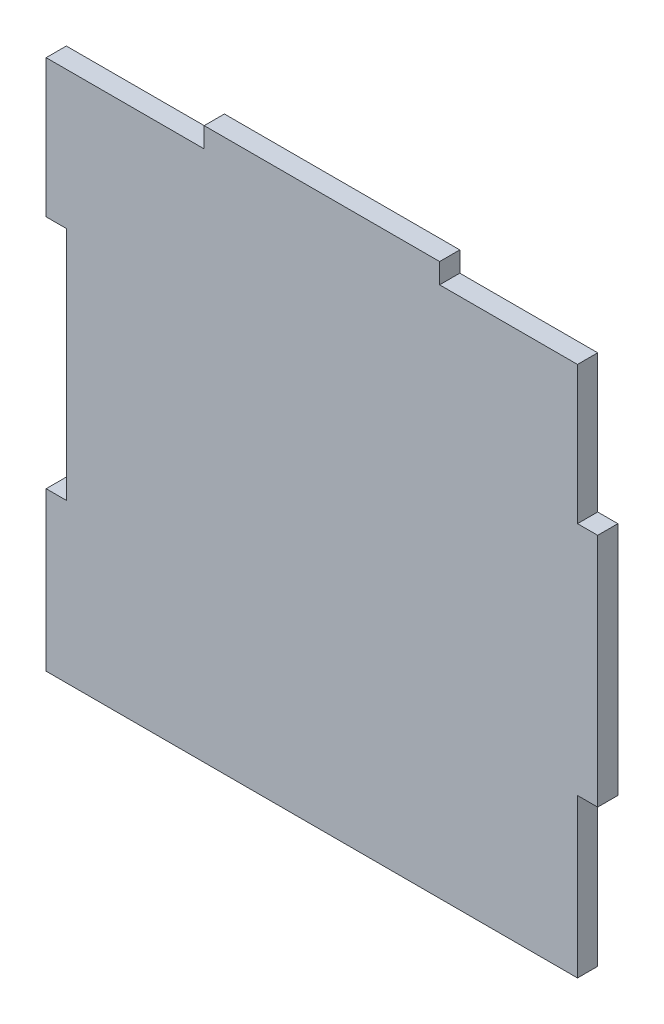
ISO-10303-21;
HEADER;
FILE_DESCRIPTION(('STEP AP214'),'2;1');
FILE_NAME('part.step','',(''),(''),'','','');
FILE_SCHEMA(('AUTOMOTIVE_DESIGN { 1 0 10303 214 1 1 1 1 }'));
ENDSEC;
DATA;
#1=APPLICATION_CONTEXT('core data for automotive mechanical design processes');
#2=APPLICATION_PROTOCOL_DEFINITION('international standard','automotive_design',2000,#1);
#3=PRODUCT_CONTEXT('',#1,'mechanical');
#4=PRODUCT('Part','Part','',(#3));
#5=PRODUCT_RELATED_PRODUCT_CATEGORY('part','',(#4));
#6=PRODUCT_DEFINITION_FORMATION('','',#4);
#7=PRODUCT_DEFINITION_CONTEXT('part definition',#1,'design');
#8=PRODUCT_DEFINITION('design','',#6,#7);
#9=PRODUCT_DEFINITION_SHAPE('','',#8);
#10=(LENGTH_UNIT() NAMED_UNIT(*) SI_UNIT(.MILLI.,.METRE.));
#11=(NAMED_UNIT(*) PLANE_ANGLE_UNIT() SI_UNIT($,.RADIAN.));
#12=(NAMED_UNIT(*) SI_UNIT($,.STERADIAN.) SOLID_ANGLE_UNIT());
#13=UNCERTAINTY_MEASURE_WITH_UNIT(LENGTH_MEASURE(1.E-05),#10,'distance_accuracy_value','');
#14=(GEOMETRIC_REPRESENTATION_CONTEXT(3) GLOBAL_UNCERTAINTY_ASSIGNED_CONTEXT((#13)) GLOBAL_UNIT_ASSIGNED_CONTEXT((#10,
#11,#12)) REPRESENTATION_CONTEXT('',''));
#15=CARTESIAN_POINT('',(0.,0.,0.));
#16=DIRECTION('',(0.,0.,1.));
#17=DIRECTION('',(1.,0.,0.));
#18=AXIS2_PLACEMENT_3D('',#15,#16,#17);
#19=CARTESIAN_POINT('',(38.,-16.,3.));
#20=DIRECTION('',(0.,1.,0.));
#21=DIRECTION('',(-1.,0.,0.));
#22=AXIS2_PLACEMENT_3D('',#19,#20,#21);
#23=PLANE('',#22);
#24=DIRECTION('',(1.,0.,0.));
#25=VECTOR('',#24,1.);
#26=CARTESIAN_POINT('',(38.,-16.,0.));
#27=LINE('',#26,#25);
#28=CARTESIAN_POINT('',(38.,-16.,0.));
#29=VERTEX_POINT('',#28);
#30=CARTESIAN_POINT('',(41.,-16.,0.));
#31=VERTEX_POINT('',#30);
#32=EDGE_CURVE('E181',#29,#31,#27,.T.);
#33=ORIENTED_EDGE('',*,*,#32,.T.);
#34=DIRECTION('',(0.,0.,-1.));
#35=VECTOR('',#34,1.);
#36=CARTESIAN_POINT('',(41.,-16.,3.));
#37=LINE('',#36,#35);
#38=CARTESIAN_POINT('',(41.,-16.,3.));
#39=VERTEX_POINT('',#38);
#40=EDGE_CURVE('E11',#39,#31,#37,.T.);
#41=ORIENTED_EDGE('',*,*,#40,.F.);
#42=DIRECTION('',(1.,0.,0.));
#43=VECTOR('',#42,1.);
#44=CARTESIAN_POINT('',(38.,-16.,3.));
#45=LINE('',#44,#43);
#46=CARTESIAN_POINT('',(38.,-16.,3.));
#47=VERTEX_POINT('',#46);
#48=EDGE_CURVE('E215',#47,#39,#45,.T.);
#49=ORIENTED_EDGE('',*,*,#48,.F.);
#50=DIRECTION('',(0.,0.,-1.));
#51=VECTOR('',#50,1.);
#52=CARTESIAN_POINT('',(38.,-16.,3.));
#53=LINE('',#52,#51);
#54=EDGE_CURVE('E177',#47,#29,#53,.T.);
#55=ORIENTED_EDGE('',*,*,#54,.T.);
#56=EDGE_LOOP('',(#33,#41,#49,#55));
#57=FACE_BOUND('',#56,.T.);
#58=ADVANCED_FACE('F37',(#57),#23,.F.);
#59=CARTESIAN_POINT('',(41.,16.,3.));
#60=DIRECTION('',(-1.,0.,0.));
#61=DIRECTION('',(0.,0.,1.));
#62=AXIS2_PLACEMENT_3D('',#59,#60,#61);
#63=PLANE('',#62);
#64=DIRECTION('',(0.,1.,0.));
#65=VECTOR('',#64,1.);
#66=CARTESIAN_POINT('',(41.,16.,0.));
#67=LINE('',#66,#65);
#68=CARTESIAN_POINT('',(41.,19.,0.));
#69=VERTEX_POINT('',#68);
#70=EDGE_CURVE('E184',#31,#69,#67,.T.);
#71=ORIENTED_EDGE('',*,*,#70,.T.);
#72=DIRECTION('',(0.,0.,-1.));
#73=VECTOR('',#72,1.);
#74=CARTESIAN_POINT('',(41.,19.,3.));
#75=LINE('',#74,#73);
#76=CARTESIAN_POINT('',(41.,19.,3.));
#77=VERTEX_POINT('',#76);
#78=EDGE_CURVE('E45',#77,#69,#75,.T.);
#79=ORIENTED_EDGE('',*,*,#78,.F.);
#80=DIRECTION('',(0.,1.,0.));
#81=VECTOR('',#80,1.);
#82=CARTESIAN_POINT('',(41.,16.,3.));
#83=LINE('',#82,#81);
#84=EDGE_CURVE('E118',#39,#77,#83,.T.);
#85=ORIENTED_EDGE('',*,*,#84,.F.);
#86=ORIENTED_EDGE('',*,*,#40,.T.);
#87=EDGE_LOOP('',(#71,#79,#85,#86));
#88=FACE_BOUND('',#87,.T.);
#89=ADVANCED_FACE('F303',(#88),#63,.F.);
#90=CARTESIAN_POINT('',(41.,19.,3.));
#91=DIRECTION('',(0.,-1.,0.));
#92=DIRECTION('',(0.,0.,-1.));
#93=AXIS2_PLACEMENT_3D('',#90,#91,#92);
#94=PLANE('',#93);
#95=DIRECTION('',(-1.,0.,0.));
#96=VECTOR('',#95,1.);
#97=CARTESIAN_POINT('',(41.,19.,0.));
#98=LINE('',#97,#96);
#99=CARTESIAN_POINT('',(38.,19.,0.));
#100=VERTEX_POINT('',#99);
#101=EDGE_CURVE('E186',#69,#100,#98,.T.);
#102=ORIENTED_EDGE('',*,*,#101,.T.);
#103=DIRECTION('',(0.,0.,-1.));
#104=VECTOR('',#103,1.);
#105=CARTESIAN_POINT('',(38.,19.,3.));
#106=LINE('',#105,#104);
#107=CARTESIAN_POINT('',(38.,19.,3.));
#108=VERTEX_POINT('',#107);
#109=EDGE_CURVE('E246',#108,#100,#106,.T.);
#110=ORIENTED_EDGE('',*,*,#109,.F.);
#111=DIRECTION('',(-1.,0.,0.));
#112=VECTOR('',#111,1.);
#113=CARTESIAN_POINT('',(41.,19.,3.));
#114=LINE('',#113,#112);
#115=EDGE_CURVE('E254',#77,#108,#114,.T.);
#116=ORIENTED_EDGE('',*,*,#115,.F.);
#117=ORIENTED_EDGE('',*,*,#78,.T.);
#118=EDGE_LOOP('',(#102,#110,#116,#117));
#119=FACE_BOUND('',#118,.T.);
#120=ADVANCED_FACE('F252',(#119),#94,.F.);
#121=CARTESIAN_POINT('',(38.,39.5,3.));
#122=DIRECTION('',(-1.,0.,0.));
#123=DIRECTION('',(0.,-1.,0.));
#124=AXIS2_PLACEMENT_3D('',#121,#122,#123);
#125=PLANE('',#124);
#126=DIRECTION('',(0.,1.,0.));
#127=VECTOR('',#126,1.);
#128=CARTESIAN_POINT('',(38.,39.5,0.));
#129=LINE('',#128,#127);
#130=CARTESIAN_POINT('',(38.,39.5,0.));
#131=VERTEX_POINT('',#130);
#132=EDGE_CURVE('E188',#100,#131,#129,.T.);
#133=ORIENTED_EDGE('',*,*,#132,.T.);
#134=DIRECTION('',(0.,0.,-1.));
#135=VECTOR('',#134,1.);
#136=CARTESIAN_POINT('',(38.,39.5,3.));
#137=LINE('',#136,#135);
#138=CARTESIAN_POINT('',(38.,39.5,3.));
#139=VERTEX_POINT('',#138);
#140=EDGE_CURVE('E243',#139,#131,#137,.T.);
#141=ORIENTED_EDGE('',*,*,#140,.F.);
#142=DIRECTION('',(0.,1.,0.));
#143=VECTOR('',#142,1.);
#144=CARTESIAN_POINT('',(38.,39.5,3.));
#145=LINE('',#144,#143);
#146=EDGE_CURVE('E270',#108,#139,#145,.T.);
#147=ORIENTED_EDGE('',*,*,#146,.F.);
#148=ORIENTED_EDGE('',*,*,#109,.T.);
#149=EDGE_LOOP('',(#133,#141,#147,#148));
#150=FACE_BOUND('',#149,.T.);
#151=ADVANCED_FACE('F261',(#150),#125,.F.);
#152=CARTESIAN_POINT('',(17.5,39.5,3.));
#153=DIRECTION('',(0.,-1.,0.));
#154=DIRECTION('',(1.,0.,0.));
#155=AXIS2_PLACEMENT_3D('',#152,#153,#154);
#156=PLANE('',#155);
#157=DIRECTION('',(-1.,0.,0.));
#158=VECTOR('',#157,1.);
#159=CARTESIAN_POINT('',(17.5,39.5,0.));
#160=LINE('',#159,#158);
#161=CARTESIAN_POINT('',(17.5,39.5,0.));
#162=VERTEX_POINT('',#161);
#163=EDGE_CURVE('E190',#131,#162,#160,.T.);
#164=ORIENTED_EDGE('',*,*,#163,.T.);
#165=DIRECTION('',(0.,0.,-1.));
#166=VECTOR('',#165,1.);
#167=CARTESIAN_POINT('',(17.5,39.5,3.));
#168=LINE('',#167,#166);
#169=CARTESIAN_POINT('',(17.5,39.5,3.));
#170=VERTEX_POINT('',#169);
#171=EDGE_CURVE('E240',#170,#162,#168,.T.);
#172=ORIENTED_EDGE('',*,*,#171,.F.);
#173=DIRECTION('',(-1.,0.,0.));
#174=VECTOR('',#173,1.);
#175=CARTESIAN_POINT('',(17.5,39.5,3.));
#176=LINE('',#175,#174);
#177=EDGE_CURVE('E267',#139,#170,#176,.T.);
#178=ORIENTED_EDGE('',*,*,#177,.F.);
#179=ORIENTED_EDGE('',*,*,#140,.T.);
#180=EDGE_LOOP('',(#164,#172,#178,#179));
#181=FACE_BOUND('',#180,.T.);
#182=ADVANCED_FACE('F265',(#181),#156,.F.);
#183=CARTESIAN_POINT('',(17.5,42.5,3.));
#184=DIRECTION('',(-1.,0.,0.));
#185=DIRECTION('',(0.,-1.,0.));
#186=AXIS2_PLACEMENT_3D('',#183,#184,#185);
#187=PLANE('',#186);
#188=DIRECTION('',(0.,1.,0.));
#189=VECTOR('',#188,1.);
#190=CARTESIAN_POINT('',(17.5,42.5,0.));
#191=LINE('',#190,#189);
#192=CARTESIAN_POINT('',(17.5,42.5,0.));
#193=VERTEX_POINT('',#192);
#194=EDGE_CURVE('E192',#162,#193,#191,.T.);
#195=ORIENTED_EDGE('',*,*,#194,.T.);
#196=DIRECTION('',(0.,0.,-1.));
#197=VECTOR('',#196,1.);
#198=CARTESIAN_POINT('',(17.5,42.5,3.));
#199=LINE('',#198,#197);
#200=CARTESIAN_POINT('',(17.5,42.5,3.));
#201=VERTEX_POINT('',#200);
#202=EDGE_CURVE('E237',#201,#193,#199,.T.);
#203=ORIENTED_EDGE('',*,*,#202,.F.);
#204=DIRECTION('',(0.,1.,0.));
#205=VECTOR('',#204,1.);
#206=CARTESIAN_POINT('',(17.5,42.5,3.));
#207=LINE('',#206,#205);
#208=EDGE_CURVE('E269',#170,#201,#207,.T.);
#209=ORIENTED_EDGE('',*,*,#208,.F.);
#210=ORIENTED_EDGE('',*,*,#171,.T.);
#211=EDGE_LOOP('',(#195,#203,#209,#210));
#212=FACE_BOUND('',#211,.T.);
#213=ADVANCED_FACE('F315',(#212),#187,.F.);
#214=CARTESIAN_POINT('',(-17.5,42.5,3.));
#215=DIRECTION('',(0.,-1.,0.));
#216=DIRECTION('',(0.,0.,-1.));
#217=AXIS2_PLACEMENT_3D('',#214,#215,#216);
#218=PLANE('',#217);
#219=DIRECTION('',(-1.,0.,0.));
#220=VECTOR('',#219,1.);
#221=CARTESIAN_POINT('',(-17.5,42.5,0.));
#222=LINE('',#221,#220);
#223=CARTESIAN_POINT('',(-17.5,42.5,0.));
#224=VERTEX_POINT('',#223);
#225=EDGE_CURVE('E194',#193,#224,#222,.T.);
#226=ORIENTED_EDGE('',*,*,#225,.T.);
#227=DIRECTION('',(0.,0.,-1.));
#228=VECTOR('',#227,1.);
#229=CARTESIAN_POINT('',(-17.5,42.5,3.));
#230=LINE('',#229,#228);
#231=CARTESIAN_POINT('',(-17.5,42.5,3.));
#232=VERTEX_POINT('',#231);
#233=EDGE_CURVE('E234',#232,#224,#230,.T.);
#234=ORIENTED_EDGE('',*,*,#233,.F.);
#235=DIRECTION('',(-1.,0.,0.));
#236=VECTOR('',#235,1.);
#237=CARTESIAN_POINT('',(-17.5,42.5,3.));
#238=LINE('',#237,#236);
#239=EDGE_CURVE('E272',#201,#232,#238,.T.);
#240=ORIENTED_EDGE('',*,*,#239,.F.);
#241=ORIENTED_EDGE('',*,*,#202,.T.);
#242=EDGE_LOOP('',(#226,#234,#240,#241));
#243=FACE_BOUND('',#242,.T.);
#244=ADVANCED_FACE('F318',(#243),#218,.F.);
#245=CARTESIAN_POINT('',(-17.5,39.5,3.));
#246=DIRECTION('',(1.,0.,0.));
#247=DIRECTION('',(0.,0.,-1.));
#248=AXIS2_PLACEMENT_3D('',#245,#246,#247);
#249=PLANE('',#248);
#250=DIRECTION('',(0.,-1.,0.));
#251=VECTOR('',#250,1.);
#252=CARTESIAN_POINT('',(-17.5,39.5,0.));
#253=LINE('',#252,#251);
#254=CARTESIAN_POINT('',(-17.5,39.5,0.));
#255=VERTEX_POINT('',#254);
#256=EDGE_CURVE('E196',#224,#255,#253,.T.);
#257=ORIENTED_EDGE('',*,*,#256,.T.);
#258=DIRECTION('',(0.,0.,-1.));
#259=VECTOR('',#258,1.);
#260=CARTESIAN_POINT('',(-17.5,39.5,3.));
#261=LINE('',#260,#259);
#262=CARTESIAN_POINT('',(-17.5,39.5,3.));
#263=VERTEX_POINT('',#262);
#264=EDGE_CURVE('E231',#263,#255,#261,.T.);
#265=ORIENTED_EDGE('',*,*,#264,.F.);
#266=DIRECTION('',(0.,-1.,0.));
#267=VECTOR('',#266,1.);
#268=CARTESIAN_POINT('',(-17.5,39.5,3.));
#269=LINE('',#268,#267);
#270=EDGE_CURVE('E278',#232,#263,#269,.T.);
#271=ORIENTED_EDGE('',*,*,#270,.F.);
#272=ORIENTED_EDGE('',*,*,#233,.T.);
#273=EDGE_LOOP('',(#257,#265,#271,#272));
#274=FACE_BOUND('',#273,.T.);
#275=ADVANCED_FACE('F322',(#274),#249,.F.);
#276=CARTESIAN_POINT('',(-41.,39.5,3.));
#277=DIRECTION('',(0.,-1.,0.));
#278=DIRECTION('',(0.,0.,-1.));
#279=AXIS2_PLACEMENT_3D('',#276,#277,#278);
#280=PLANE('',#279);
#281=DIRECTION('',(-1.,0.,0.));
#282=VECTOR('',#281,1.);
#283=CARTESIAN_POINT('',(-41.,39.5,0.));
#284=LINE('',#283,#282);
#285=CARTESIAN_POINT('',(-41.,39.5,0.));
#286=VERTEX_POINT('',#285);
#287=EDGE_CURVE('E199',#255,#286,#284,.T.);
#288=ORIENTED_EDGE('',*,*,#287,.T.);
#289=DIRECTION('',(0.,0.,-1.));
#290=VECTOR('',#289,1.);
#291=CARTESIAN_POINT('',(-41.,39.5,3.));
#292=LINE('',#291,#290);
#293=CARTESIAN_POINT('',(-41.,39.5,3.));
#294=VERTEX_POINT('',#293);
#295=EDGE_CURVE('E228',#294,#286,#292,.T.);
#296=ORIENTED_EDGE('',*,*,#295,.F.);
#297=DIRECTION('',(-1.,0.,0.));
#298=VECTOR('',#297,1.);
#299=CARTESIAN_POINT('',(-38.,39.5,3.));
#300=LINE('',#299,#298);
#301=EDGE_CURVE('E280',#263,#294,#300,.T.);
#302=ORIENTED_EDGE('',*,*,#301,.F.);
#303=ORIENTED_EDGE('',*,*,#264,.T.);
#304=EDGE_LOOP('',(#288,#296,#302,#303));
#305=FACE_BOUND('',#304,.T.);
#306=ADVANCED_FACE('F326',(#305),#280,.F.);
#307=CARTESIAN_POINT('',(-41.,19.,3.));
#308=DIRECTION('',(1.,0.,0.));
#309=DIRECTION('',(0.,1.,0.));
#310=AXIS2_PLACEMENT_3D('',#307,#308,#309);
#311=PLANE('',#310);
#312=DIRECTION('',(0.,-1.,0.));
#313=VECTOR('',#312,1.);
#314=CARTESIAN_POINT('',(-41.,19.,0.));
#315=LINE('',#314,#313);
#316=CARTESIAN_POINT('',(-41.,19.,0.));
#317=VERTEX_POINT('',#316);
#318=EDGE_CURVE('E201',#286,#317,#315,.T.);
#319=ORIENTED_EDGE('',*,*,#318,.T.);
#320=DIRECTION('',(0.,0.,-1.));
#321=VECTOR('',#320,1.);
#322=CARTESIAN_POINT('',(-41.,19.,3.));
#323=LINE('',#322,#321);
#324=CARTESIAN_POINT('',(-41.,19.,3.));
#325=VERTEX_POINT('',#324);
#326=EDGE_CURVE('E225',#325,#317,#323,.T.);
#327=ORIENTED_EDGE('',*,*,#326,.F.);
#328=DIRECTION('',(0.,-1.,0.));
#329=VECTOR('',#328,1.);
#330=CARTESIAN_POINT('',(-41.,19.,3.));
#331=LINE('',#330,#329);
#332=EDGE_CURVE('E282',#294,#325,#331,.T.);
#333=ORIENTED_EDGE('',*,*,#332,.F.);
#334=ORIENTED_EDGE('',*,*,#295,.T.);
#335=EDGE_LOOP('',(#319,#327,#333,#334));
#336=FACE_BOUND('',#335,.T.);
#337=ADVANCED_FACE('F330',(#336),#311,.F.);
#338=CARTESIAN_POINT('',(-38.,19.,3.));
#339=DIRECTION('',(0.,1.,0.));
#340=DIRECTION('',(-1.,0.,0.));
#341=AXIS2_PLACEMENT_3D('',#338,#339,#340);
#342=PLANE('',#341);
#343=DIRECTION('',(1.,0.,0.));
#344=VECTOR('',#343,1.);
#345=CARTESIAN_POINT('',(-38.,19.,0.));
#346=LINE('',#345,#344);
#347=CARTESIAN_POINT('',(-38.,19.,0.));
#348=VERTEX_POINT('',#347);
#349=EDGE_CURVE('E203',#317,#348,#346,.T.);
#350=ORIENTED_EDGE('',*,*,#349,.T.);
#351=DIRECTION('',(0.,0.,-1.));
#352=VECTOR('',#351,1.);
#353=CARTESIAN_POINT('',(-38.,19.,3.));
#354=LINE('',#353,#352);
#355=CARTESIAN_POINT('',(-38.,19.,3.));
#356=VERTEX_POINT('',#355);
#357=EDGE_CURVE('E222',#356,#348,#354,.T.);
#358=ORIENTED_EDGE('',*,*,#357,.F.);
#359=DIRECTION('',(1.,0.,0.));
#360=VECTOR('',#359,1.);
#361=CARTESIAN_POINT('',(-38.,19.,3.));
#362=LINE('',#361,#360);
#363=EDGE_CURVE('E284',#325,#356,#362,.T.);
#364=ORIENTED_EDGE('',*,*,#363,.F.);
#365=ORIENTED_EDGE('',*,*,#326,.T.);
#366=EDGE_LOOP('',(#350,#358,#364,#365));
#367=FACE_BOUND('',#366,.T.);
#368=ADVANCED_FACE('F334',(#367),#342,.F.);
#369=CARTESIAN_POINT('',(-38.,16.,3.));
#370=DIRECTION('',(1.,0.,0.));
#371=DIRECTION('',(0.,0.,-1.));
#372=AXIS2_PLACEMENT_3D('',#369,#370,#371);
#373=PLANE('',#372);
#374=DIRECTION('',(0.,-1.,0.));
#375=VECTOR('',#374,1.);
#376=CARTESIAN_POINT('',(-38.,16.,0.));
#377=LINE('',#376,#375);
#378=CARTESIAN_POINT('',(-38.,-16.,0.));
#379=VERTEX_POINT('',#378);
#380=EDGE_CURVE('E206',#348,#379,#377,.T.);
#381=ORIENTED_EDGE('',*,*,#380,.T.);
#382=DIRECTION('',(0.,0.,-1.));
#383=VECTOR('',#382,1.);
#384=CARTESIAN_POINT('',(-38.,-16.,3.));
#385=LINE('',#384,#383);
#386=CARTESIAN_POINT('',(-38.,-16.,3.));
#387=VERTEX_POINT('',#386);
#388=EDGE_CURVE('E219',#387,#379,#385,.T.);
#389=ORIENTED_EDGE('',*,*,#388,.F.);
#390=DIRECTION('',(0.,-1.,0.));
#391=VECTOR('',#390,1.);
#392=CARTESIAN_POINT('',(-38.,16.,3.));
#393=LINE('',#392,#391);
#394=EDGE_CURVE('E286',#356,#387,#393,.T.);
#395=ORIENTED_EDGE('',*,*,#394,.F.);
#396=ORIENTED_EDGE('',*,*,#357,.T.);
#397=EDGE_LOOP('',(#381,#389,#395,#396));
#398=FACE_BOUND('',#397,.T.);
#399=ADVANCED_FACE('F292',(#398),#373,.F.);
#400=CARTESIAN_POINT('',(-41.,-16.,3.));
#401=DIRECTION('',(0.,-1.,0.));
#402=DIRECTION('',(0.,0.,-1.));
#403=AXIS2_PLACEMENT_3D('',#400,#401,#402);
#404=PLANE('',#403);
#405=DIRECTION('',(-1.,0.,0.));
#406=VECTOR('',#405,1.);
#407=CARTESIAN_POINT('',(-41.,-16.,0.));
#408=LINE('',#407,#406);
#409=CARTESIAN_POINT('',(-41.,-16.,0.));
#410=VERTEX_POINT('',#409);
#411=EDGE_CURVE('E208',#379,#410,#408,.T.);
#412=ORIENTED_EDGE('',*,*,#411,.T.);
#413=DIRECTION('',(0.,0.,-1.));
#414=VECTOR('',#413,1.);
#415=CARTESIAN_POINT('',(-41.,-16.,3.));
#416=LINE('',#415,#414);
#417=CARTESIAN_POINT('',(-41.,-16.,3.));
#418=VERTEX_POINT('',#417);
#419=EDGE_CURVE('E172',#418,#410,#416,.T.);
#420=ORIENTED_EDGE('',*,*,#419,.F.);
#421=DIRECTION('',(-1.,0.,0.));
#422=VECTOR('',#421,1.);
#423=CARTESIAN_POINT('',(-41.,-16.,3.));
#424=LINE('',#423,#422);
#425=EDGE_CURVE('E162',#387,#418,#424,.T.);
#426=ORIENTED_EDGE('',*,*,#425,.F.);
#427=ORIENTED_EDGE('',*,*,#388,.T.);
#428=EDGE_LOOP('',(#412,#420,#426,#427));
#429=FACE_BOUND('',#428,.T.);
#430=ADVANCED_FACE('F295',(#429),#404,.F.);
#431=CARTESIAN_POINT('',(-41.,-19.,3.));
#432=DIRECTION('',(1.,0.,0.));
#433=DIRECTION('',(0.,1.,0.));
#434=AXIS2_PLACEMENT_3D('',#431,#432,#433);
#435=PLANE('',#434);
#436=DIRECTION('',(0.,-1.,0.));
#437=VECTOR('',#436,1.);
#438=CARTESIAN_POINT('',(-41.,-19.,0.));
#439=LINE('',#438,#437);
#440=CARTESIAN_POINT('',(-41.,-39.5,0.));
#441=VERTEX_POINT('',#440);
#442=EDGE_CURVE('E170',#410,#441,#439,.T.);
#443=ORIENTED_EDGE('',*,*,#442,.T.);
#444=DIRECTION('',(0.,0.,-1.));
#445=VECTOR('',#444,1.);
#446=CARTESIAN_POINT('',(-41.,-39.5,3.));
#447=LINE('',#446,#445);
#448=CARTESIAN_POINT('',(-41.,-39.5,3.));
#449=VERTEX_POINT('',#448);
#450=EDGE_CURVE('E168',#449,#441,#447,.T.);
#451=ORIENTED_EDGE('',*,*,#450,.F.);
#452=DIRECTION('',(0.,-1.,0.));
#453=VECTOR('',#452,1.);
#454=CARTESIAN_POINT('',(-41.,-19.,3.));
#455=LINE('',#454,#453);
#456=EDGE_CURVE('E155',#418,#449,#455,.T.);
#457=ORIENTED_EDGE('',*,*,#456,.F.);
#458=ORIENTED_EDGE('',*,*,#419,.T.);
#459=EDGE_LOOP('',(#443,#451,#457,#458));
#460=FACE_BOUND('',#459,.T.);
#461=ADVANCED_FACE('F169',(#460),#435,.F.);
#462=CARTESIAN_POINT('',(-41.,-39.5,3.));
#463=DIRECTION('',(0.,1.,0.));
#464=DIRECTION('',(0.,0.,1.));
#465=AXIS2_PLACEMENT_3D('',#462,#463,#464);
#466=PLANE('',#465);
#467=DIRECTION('',(1.,0.,0.));
#468=VECTOR('',#467,1.);
#469=CARTESIAN_POINT('',(-41.,-39.5,0.));
#470=LINE('',#469,#468);
#471=CARTESIAN_POINT('',(38.,-39.5,0.));
#472=VERTEX_POINT('',#471);
#473=EDGE_CURVE('E212',#441,#472,#470,.T.);
#474=ORIENTED_EDGE('',*,*,#473,.T.);
#475=DIRECTION('',(0.,0.,-1.));
#476=VECTOR('',#475,1.);
#477=CARTESIAN_POINT('',(38.,-39.5,3.));
#478=LINE('',#477,#476);
#479=CARTESIAN_POINT('',(38.,-39.5,3.));
#480=VERTEX_POINT('',#479);
#481=EDGE_CURVE('E173',#480,#472,#478,.T.);
#482=ORIENTED_EDGE('',*,*,#481,.F.);
#483=DIRECTION('',(1.,0.,0.));
#484=VECTOR('',#483,1.);
#485=CARTESIAN_POINT('',(-41.,-39.5,3.));
#486=LINE('',#485,#484);
#487=EDGE_CURVE('E159',#449,#480,#486,.T.);
#488=ORIENTED_EDGE('',*,*,#487,.F.);
#489=ORIENTED_EDGE('',*,*,#450,.T.);
#490=EDGE_LOOP('',(#474,#482,#488,#489));
#491=FACE_BOUND('',#490,.T.);
#492=ADVANCED_FACE('F175',(#491),#466,.F.);
#493=CARTESIAN_POINT('',(38.,-19.,3.));
#494=DIRECTION('',(-1.,0.,0.));
#495=DIRECTION('',(0.,-1.,0.));
#496=AXIS2_PLACEMENT_3D('',#493,#494,#495);
#497=PLANE('',#496);
#498=DIRECTION('',(0.,1.,0.));
#499=VECTOR('',#498,1.);
#500=CARTESIAN_POINT('',(38.,-19.,0.));
#501=LINE('',#500,#499);
#502=EDGE_CURVE('E106',#472,#29,#501,.T.);
#503=ORIENTED_EDGE('',*,*,#502,.T.);
#504=ORIENTED_EDGE('',*,*,#54,.F.);
#505=DIRECTION('',(0.,1.,0.));
#506=VECTOR('',#505,1.);
#507=CARTESIAN_POINT('',(38.,-19.,3.));
#508=LINE('',#507,#506);
#509=EDGE_CURVE('E53',#480,#47,#508,.T.);
#510=ORIENTED_EDGE('',*,*,#509,.F.);
#511=ORIENTED_EDGE('',*,*,#481,.T.);
#512=EDGE_LOOP('',(#503,#504,#510,#511));
#513=FACE_BOUND('',#512,.T.);
#514=ADVANCED_FACE('F297',(#513),#497,.F.);
#515=CARTESIAN_POINT('',(0.,0.,3.));
#516=DIRECTION('',(0.,0.,-1.));
#517=DIRECTION('',(-1.,0.,0.));
#518=AXIS2_PLACEMENT_3D('',#515,#516,#517);
#519=PLANE('',#518);
#520=ORIENTED_EDGE('',*,*,#48,.T.);
#521=ORIENTED_EDGE('',*,*,#84,.T.);
#522=ORIENTED_EDGE('',*,*,#115,.T.);
#523=ORIENTED_EDGE('',*,*,#146,.T.);
#524=ORIENTED_EDGE('',*,*,#177,.T.);
#525=ORIENTED_EDGE('',*,*,#208,.T.);
#526=ORIENTED_EDGE('',*,*,#239,.T.);
#527=ORIENTED_EDGE('',*,*,#270,.T.);
#528=ORIENTED_EDGE('',*,*,#301,.T.);
#529=ORIENTED_EDGE('',*,*,#332,.T.);
#530=ORIENTED_EDGE('',*,*,#363,.T.);
#531=ORIENTED_EDGE('',*,*,#394,.T.);
#532=ORIENTED_EDGE('',*,*,#425,.T.);
#533=ORIENTED_EDGE('',*,*,#456,.T.);
#534=ORIENTED_EDGE('',*,*,#487,.T.);
#535=ORIENTED_EDGE('',*,*,#509,.T.);
#536=EDGE_LOOP('',(#520,#521,#522,#523,#524,#525,#526,#527,#528,#529,#530,#531,#532,#533,#534,#535));
#537=FACE_BOUND('',#536,.T.);
#538=ADVANCED_FACE('F157',(#537),#519,.F.);
#539=CARTESIAN_POINT('',(0.,0.,0.));
#540=DIRECTION('',(0.,0.,-1.));
#541=DIRECTION('',(-1.,0.,0.));
#542=AXIS2_PLACEMENT_3D('',#539,#540,#541);
#543=PLANE('',#542);
#544=ORIENTED_EDGE('',*,*,#32,.F.);
#545=ORIENTED_EDGE('',*,*,#502,.F.);
#546=ORIENTED_EDGE('',*,*,#473,.F.);
#547=ORIENTED_EDGE('',*,*,#442,.F.);
#548=ORIENTED_EDGE('',*,*,#411,.F.);
#549=ORIENTED_EDGE('',*,*,#380,.F.);
#550=ORIENTED_EDGE('',*,*,#349,.F.);
#551=ORIENTED_EDGE('',*,*,#318,.F.);
#552=ORIENTED_EDGE('',*,*,#287,.F.);
#553=ORIENTED_EDGE('',*,*,#256,.F.);
#554=ORIENTED_EDGE('',*,*,#225,.F.);
#555=ORIENTED_EDGE('',*,*,#194,.F.);
#556=ORIENTED_EDGE('',*,*,#163,.F.);
#557=ORIENTED_EDGE('',*,*,#132,.F.);
#558=ORIENTED_EDGE('',*,*,#101,.F.);
#559=ORIENTED_EDGE('',*,*,#70,.F.);
#560=EDGE_LOOP('',(#544,#545,#546,#547,#548,#549,#550,#551,#552,#553,#554,#555,#556,#557,#558,#559));
#561=FACE_BOUND('',#560,.T.);
#562=ADVANCED_FACE('F256',(#561),#543,.T.);
#563=CLOSED_SHELL('',(#58,#89,#120,#151,#182,#213,#244,#275,#306,#337,#368,#399,#430,#461,#492,
#514,#538,#562));
#564=MANIFOLD_SOLID_BREP('B2',#563);
#565=ADVANCED_BREP_SHAPE_REPRESENTATION('',(#18,#564),#14);
#566=SHAPE_DEFINITION_REPRESENTATION(#9,#565);
ENDSEC;
END-ISO-10303-21;
